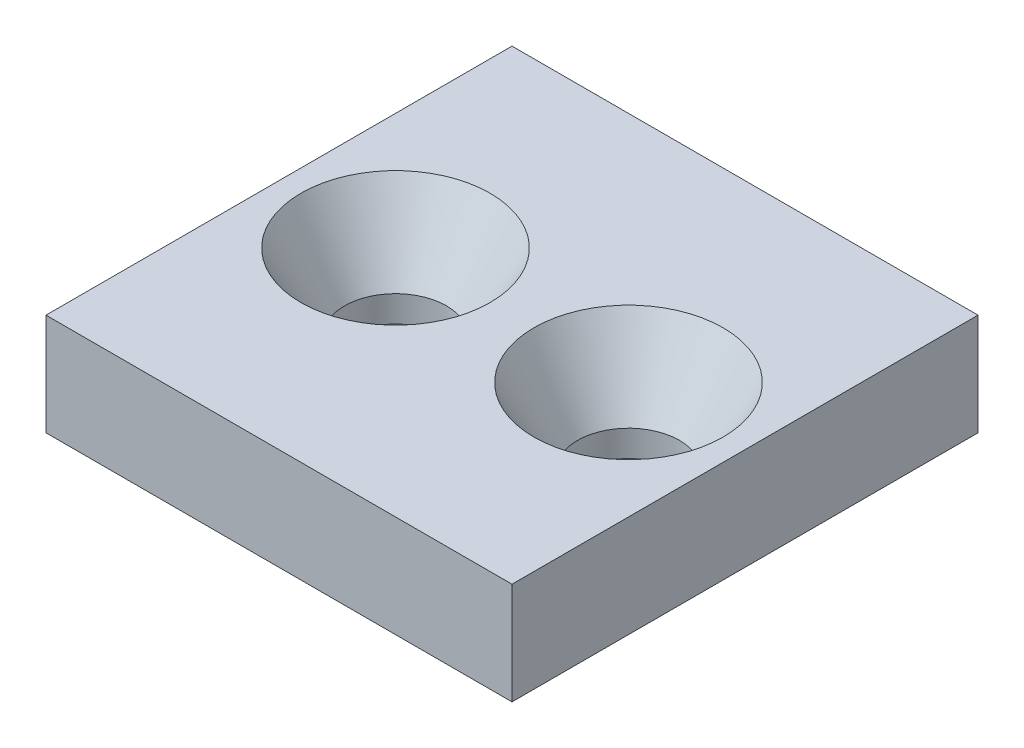
ISO-10303-21;
HEADER;
FILE_DESCRIPTION(('STEP AP214'),'2;1');
FILE_NAME('part.step','',(''),(''),'','','');
FILE_SCHEMA(('AUTOMOTIVE_DESIGN { 1 0 10303 214 1 1 1 1 }'));
ENDSEC;
DATA;
#1=APPLICATION_CONTEXT('core data for automotive mechanical design processes');
#2=APPLICATION_PROTOCOL_DEFINITION('international standard','automotive_design',2000,#1);
#3=PRODUCT_CONTEXT('',#1,'mechanical');
#4=PRODUCT('Part','Part','',(#3));
#5=PRODUCT_RELATED_PRODUCT_CATEGORY('part','',(#4));
#6=PRODUCT_DEFINITION_FORMATION('','',#4);
#7=PRODUCT_DEFINITION_CONTEXT('part definition',#1,'design');
#8=PRODUCT_DEFINITION('design','',#6,#7);
#9=PRODUCT_DEFINITION_SHAPE('','',#8);
#10=(LENGTH_UNIT() NAMED_UNIT(*) SI_UNIT(.MILLI.,.METRE.));
#11=(NAMED_UNIT(*) PLANE_ANGLE_UNIT() SI_UNIT($,.RADIAN.));
#12=(NAMED_UNIT(*) SI_UNIT($,.STERADIAN.) SOLID_ANGLE_UNIT());
#13=UNCERTAINTY_MEASURE_WITH_UNIT(LENGTH_MEASURE(1.E-05),#10,'distance_accuracy_value','');
#14=(GEOMETRIC_REPRESENTATION_CONTEXT(3) GLOBAL_UNCERTAINTY_ASSIGNED_CONTEXT((#13)) GLOBAL_UNIT_ASSIGNED_CONTEXT((#10,
#11,#12)) REPRESENTATION_CONTEXT('',''));
#15=CARTESIAN_POINT('',(0.,0.,0.));
#16=DIRECTION('',(0.,0.,1.));
#17=DIRECTION('',(1.,0.,0.));
#18=AXIS2_PLACEMENT_3D('',#15,#16,#17);
#19=CARTESIAN_POINT('',(0.,7.,0.));
#20=DIRECTION('',(0.,-1.,0.));
#21=DIRECTION('',(0.,0.,-1.));
#22=AXIS2_PLACEMENT_3D('',#19,#20,#21);
#23=PLANE('',#22);
#24=CARTESIAN_POINT('',(8.,7.,-16.));
#25=DIRECTION('',(0.,-1.,0.));
#26=DIRECTION('',(0.,0.,-1.));
#27=AXIS2_PLACEMENT_3D('',#24,#25,#26);
#28=CIRCLE('',#27,6.5);
#29=CARTESIAN_POINT('',(8.,7.,-22.5));
#30=VERTEX_POINT('',#29);
#31=EDGE_CURVE('E11',#30,#30,#28,.T.);
#32=ORIENTED_EDGE('',*,*,#31,.T.);
#33=EDGE_LOOP('',(#32));
#34=FACE_BOUND('',#33,.T.);
#35=CARTESIAN_POINT('',(24.,7.,-16.));
#36=DIRECTION('',(0.,-1.,0.));
#37=DIRECTION('',(0.,0.,-1.));
#38=AXIS2_PLACEMENT_3D('',#35,#36,#37);
#39=CIRCLE('',#38,6.5);
#40=CARTESIAN_POINT('',(24.,7.,-22.5));
#41=VERTEX_POINT('',#40);
#42=EDGE_CURVE('E133',#41,#41,#39,.T.);
#43=ORIENTED_EDGE('',*,*,#42,.T.);
#44=EDGE_LOOP('',(#43));
#45=FACE_BOUND('',#44,.T.);
#46=DIRECTION('',(0.,0.,1.));
#47=VECTOR('',#46,1.);
#48=CARTESIAN_POINT('',(0.,7.,0.));
#49=LINE('',#48,#47);
#50=CARTESIAN_POINT('',(0.,7.,-32.));
#51=VERTEX_POINT('',#50);
#52=CARTESIAN_POINT('',(0.,7.,0.));
#53=VERTEX_POINT('',#52);
#54=EDGE_CURVE('E93',#51,#53,#49,.T.);
#55=ORIENTED_EDGE('',*,*,#54,.T.);
#56=DIRECTION('',(1.,0.,0.));
#57=VECTOR('',#56,1.);
#58=CARTESIAN_POINT('',(0.,7.,0.));
#59=LINE('',#58,#57);
#60=CARTESIAN_POINT('',(32.,7.,0.));
#61=VERTEX_POINT('',#60);
#62=EDGE_CURVE('E89',#53,#61,#59,.T.);
#63=ORIENTED_EDGE('',*,*,#62,.T.);
#64=DIRECTION('',(0.,0.,-1.));
#65=VECTOR('',#64,1.);
#66=CARTESIAN_POINT('',(32.,7.,0.));
#67=LINE('',#66,#65);
#68=CARTESIAN_POINT('',(32.,7.,-32.));
#69=VERTEX_POINT('',#68);
#70=EDGE_CURVE('E91',#61,#69,#67,.T.);
#71=ORIENTED_EDGE('',*,*,#70,.T.);
#72=DIRECTION('',(-1.,0.,0.));
#73=VECTOR('',#72,1.);
#74=CARTESIAN_POINT('',(0.,7.,-32.));
#75=LINE('',#74,#73);
#76=EDGE_CURVE('E58',#69,#51,#75,.T.);
#77=ORIENTED_EDGE('',*,*,#76,.T.);
#78=EDGE_LOOP('',(#55,#63,#71,#77));
#79=FACE_BOUND('',#78,.T.);
#80=ADVANCED_FACE('F40',(#34,#45,#79),#23,.F.);
#81=CARTESIAN_POINT('',(0.,0.,0.));
#82=DIRECTION('',(0.,-1.,0.));
#83=DIRECTION('',(0.,0.,-1.));
#84=AXIS2_PLACEMENT_3D('',#81,#82,#83);
#85=PLANE('',#84);
#86=CARTESIAN_POINT('',(8.,0.,-16.));
#87=DIRECTION('',(0.,1.,0.));
#88=DIRECTION('',(0.,0.,1.));
#89=AXIS2_PLACEMENT_3D('',#86,#87,#88);
#90=CIRCLE('',#89,3.5);
#91=CARTESIAN_POINT('',(8.,0.,-12.5));
#92=VERTEX_POINT('',#91);
#93=EDGE_CURVE('E116',#92,#92,#90,.T.);
#94=ORIENTED_EDGE('',*,*,#93,.T.);
#95=EDGE_LOOP('',(#94));
#96=FACE_BOUND('',#95,.T.);
#97=DIRECTION('',(0.,0.,1.));
#98=VECTOR('',#97,1.);
#99=CARTESIAN_POINT('',(0.,0.,0.));
#100=LINE('',#99,#98);
#101=CARTESIAN_POINT('',(0.,0.,-32.));
#102=VERTEX_POINT('',#101);
#103=CARTESIAN_POINT('',(0.,0.,0.));
#104=VERTEX_POINT('',#103);
#105=EDGE_CURVE('E112',#102,#104,#100,.T.);
#106=ORIENTED_EDGE('',*,*,#105,.F.);
#107=DIRECTION('',(-1.,0.,0.));
#108=VECTOR('',#107,1.);
#109=CARTESIAN_POINT('',(0.,0.,-32.));
#110=LINE('',#109,#108);
#111=CARTESIAN_POINT('',(32.,0.,-32.));
#112=VERTEX_POINT('',#111);
#113=EDGE_CURVE('E81',#112,#102,#110,.T.);
#114=ORIENTED_EDGE('',*,*,#113,.F.);
#115=DIRECTION('',(0.,0.,-1.));
#116=VECTOR('',#115,1.);
#117=CARTESIAN_POINT('',(32.,0.,0.));
#118=LINE('',#117,#116);
#119=CARTESIAN_POINT('',(32.,0.,0.));
#120=VERTEX_POINT('',#119);
#121=EDGE_CURVE('E75',#120,#112,#118,.T.);
#122=ORIENTED_EDGE('',*,*,#121,.F.);
#123=DIRECTION('',(1.,0.,0.));
#124=VECTOR('',#123,1.);
#125=CARTESIAN_POINT('',(0.,0.,0.));
#126=LINE('',#125,#124);
#127=EDGE_CURVE('E99',#104,#120,#126,.T.);
#128=ORIENTED_EDGE('',*,*,#127,.F.);
#129=EDGE_LOOP('',(#106,#114,#122,#128));
#130=FACE_BOUND('',#129,.T.);
#131=CARTESIAN_POINT('',(24.,0.,-16.));
#132=DIRECTION('',(0.,1.,0.));
#133=DIRECTION('',(0.,0.,1.));
#134=AXIS2_PLACEMENT_3D('',#131,#132,#133);
#135=CIRCLE('',#134,3.5);
#136=CARTESIAN_POINT('',(24.,0.,-12.5));
#137=VERTEX_POINT('',#136);
#138=EDGE_CURVE('E182',#137,#137,#135,.T.);
#139=ORIENTED_EDGE('',*,*,#138,.T.);
#140=EDGE_LOOP('',(#139));
#141=FACE_BOUND('',#140,.T.);
#142=ADVANCED_FACE('F153',(#96,#130,#141),#85,.T.);
#143=CARTESIAN_POINT('',(0.,7.,0.));
#144=DIRECTION('',(1.,0.,0.));
#145=DIRECTION('',(0.,0.,-1.));
#146=AXIS2_PLACEMENT_3D('',#143,#144,#145);
#147=PLANE('',#146);
#148=ORIENTED_EDGE('',*,*,#105,.T.);
#149=DIRECTION('',(0.,-1.,0.));
#150=VECTOR('',#149,1.);
#151=CARTESIAN_POINT('',(0.,7.,0.));
#152=LINE('',#151,#150);
#153=EDGE_CURVE('E101',#53,#104,#152,.T.);
#154=ORIENTED_EDGE('',*,*,#153,.F.);
#155=ORIENTED_EDGE('',*,*,#54,.F.);
#156=DIRECTION('',(0.,-1.,0.));
#157=VECTOR('',#156,1.);
#158=CARTESIAN_POINT('',(0.,7.,-32.));
#159=LINE('',#158,#157);
#160=EDGE_CURVE('E108',#51,#102,#159,.T.);
#161=ORIENTED_EDGE('',*,*,#160,.T.);
#162=EDGE_LOOP('',(#148,#154,#155,#161));
#163=FACE_BOUND('',#162,.T.);
#164=ADVANCED_FACE('F159',(#163),#147,.F.);
#165=CARTESIAN_POINT('',(0.,7.,0.));
#166=DIRECTION('',(0.,0.,-1.));
#167=DIRECTION('',(-1.,0.,0.));
#168=AXIS2_PLACEMENT_3D('',#165,#166,#167);
#169=PLANE('',#168);
#170=ORIENTED_EDGE('',*,*,#127,.T.);
#171=DIRECTION('',(0.,-1.,0.));
#172=VECTOR('',#171,1.);
#173=CARTESIAN_POINT('',(32.,7.,0.));
#174=LINE('',#173,#172);
#175=EDGE_CURVE('E97',#61,#120,#174,.T.);
#176=ORIENTED_EDGE('',*,*,#175,.F.);
#177=ORIENTED_EDGE('',*,*,#62,.F.);
#178=ORIENTED_EDGE('',*,*,#153,.T.);
#179=EDGE_LOOP('',(#170,#176,#177,#178));
#180=FACE_BOUND('',#179,.T.);
#181=ADVANCED_FACE('F98',(#180),#169,.F.);
#182=CARTESIAN_POINT('',(32.,7.,0.));
#183=DIRECTION('',(-1.,0.,0.));
#184=DIRECTION('',(0.,0.,1.));
#185=AXIS2_PLACEMENT_3D('',#182,#183,#184);
#186=PLANE('',#185);
#187=ORIENTED_EDGE('',*,*,#121,.T.);
#188=DIRECTION('',(0.,-1.,0.));
#189=VECTOR('',#188,1.);
#190=CARTESIAN_POINT('',(32.,7.,-32.));
#191=LINE('',#190,#189);
#192=EDGE_CURVE('E102',#69,#112,#191,.T.);
#193=ORIENTED_EDGE('',*,*,#192,.F.);
#194=ORIENTED_EDGE('',*,*,#70,.F.);
#195=ORIENTED_EDGE('',*,*,#175,.T.);
#196=EDGE_LOOP('',(#187,#193,#194,#195));
#197=FACE_BOUND('',#196,.T.);
#198=ADVANCED_FACE('F104',(#197),#186,.F.);
#199=CARTESIAN_POINT('',(0.,7.,-32.));
#200=DIRECTION('',(0.,0.,1.));
#201=DIRECTION('',(1.,0.,0.));
#202=AXIS2_PLACEMENT_3D('',#199,#200,#201);
#203=PLANE('',#202);
#204=ORIENTED_EDGE('',*,*,#113,.T.);
#205=ORIENTED_EDGE('',*,*,#160,.F.);
#206=ORIENTED_EDGE('',*,*,#76,.F.);
#207=ORIENTED_EDGE('',*,*,#192,.T.);
#208=EDGE_LOOP('',(#204,#205,#206,#207));
#209=FACE_BOUND('',#208,.T.);
#210=ADVANCED_FACE('F166',(#209),#203,.F.);
#211=CARTESIAN_POINT('',(8.,7.,-16.));
#212=DIRECTION('',(0.,-1.,0.));
#213=DIRECTION('',(0.,0.,-1.));
#214=AXIS2_PLACEMENT_3D('',#211,#212,#213);
#215=CYLINDRICAL_SURFACE('',#214,3.5);
#216=CARTESIAN_POINT('',(8.,1.80384757729338,-16.));
#217=DIRECTION('',(0.,-1.,0.));
#218=DIRECTION('',(0.,0.,-1.));
#219=AXIS2_PLACEMENT_3D('',#216,#217,#218);
#220=CIRCLE('',#219,3.5);
#221=CARTESIAN_POINT('',(8.,1.80384757729338,-19.5));
#222=VERTEX_POINT('',#221);
#223=EDGE_CURVE('E50',#222,#222,#220,.F.);
#224=ORIENTED_EDGE('',*,*,#223,.T.);
#225=EDGE_LOOP('',(#224));
#226=FACE_BOUND('',#225,.T.);
#227=ORIENTED_EDGE('',*,*,#93,.F.);
#228=EDGE_LOOP('',(#227));
#229=FACE_BOUND('',#228,.T.);
#230=ADVANCED_FACE('F140',(#226,#229),#215,.F.);
#231=CARTESIAN_POINT('',(24.,7.,-16.));
#232=DIRECTION('',(0.,-1.,0.));
#233=DIRECTION('',(0.,0.,-1.));
#234=AXIS2_PLACEMENT_3D('',#231,#232,#233);
#235=CYLINDRICAL_SURFACE('',#234,3.5);
#236=CARTESIAN_POINT('',(24.,1.80384757729338,-16.));
#237=DIRECTION('',(0.,-1.,0.));
#238=DIRECTION('',(0.,0.,-1.));
#239=AXIS2_PLACEMENT_3D('',#236,#237,#238);
#240=CIRCLE('',#239,3.5);
#241=CARTESIAN_POINT('',(24.,1.80384757729338,-19.5));
#242=VERTEX_POINT('',#241);
#243=EDGE_CURVE('E129',#242,#242,#240,.F.);
#244=ORIENTED_EDGE('',*,*,#243,.T.);
#245=EDGE_LOOP('',(#244));
#246=FACE_BOUND('',#245,.T.);
#247=ORIENTED_EDGE('',*,*,#138,.F.);
#248=EDGE_LOOP('',(#247));
#249=FACE_BOUND('',#248,.T.);
#250=ADVANCED_FACE('F149',(#246,#249),#235,.F.);
#251=CARTESIAN_POINT('',(24.,1.80384757729338,-16.));
#252=DIRECTION('',(0.,1.,0.));
#253=DIRECTION('',(0.,0.,1.));
#254=AXIS2_PLACEMENT_3D('',#251,#252,#253);
#255=CONICAL_SURFACE('',#254,3.5,0.5235987755983);
#256=ORIENTED_EDGE('',*,*,#42,.F.);
#257=EDGE_LOOP('',(#256));
#258=FACE_BOUND('',#257,.T.);
#259=ORIENTED_EDGE('',*,*,#243,.F.);
#260=EDGE_LOOP('',(#259));
#261=FACE_BOUND('',#260,.T.);
#262=ADVANCED_FACE('F144',(#258,#261),#255,.F.);
#263=CARTESIAN_POINT('',(8.,1.80384757729338,-16.));
#264=DIRECTION('',(0.,1.,0.));
#265=DIRECTION('',(0.,0.,1.));
#266=AXIS2_PLACEMENT_3D('',#263,#264,#265);
#267=CONICAL_SURFACE('',#266,3.5,0.5235987755983);
#268=ORIENTED_EDGE('',*,*,#31,.F.);
#269=EDGE_LOOP('',(#268));
#270=FACE_BOUND('',#269,.T.);
#271=ORIENTED_EDGE('',*,*,#223,.F.);
#272=EDGE_LOOP('',(#271));
#273=FACE_BOUND('',#272,.T.);
#274=ADVANCED_FACE('F42',(#270,#273),#267,.F.);
#275=CLOSED_SHELL('',(#80,#142,#164,#181,#198,#210,#230,#250,#262,#274));
#276=MANIFOLD_SOLID_BREP('B2',#275);
#277=ADVANCED_BREP_SHAPE_REPRESENTATION('',(#18,#276),#14);
#278=SHAPE_DEFINITION_REPRESENTATION(#9,#277);
ENDSEC;
END-ISO-10303-21;
